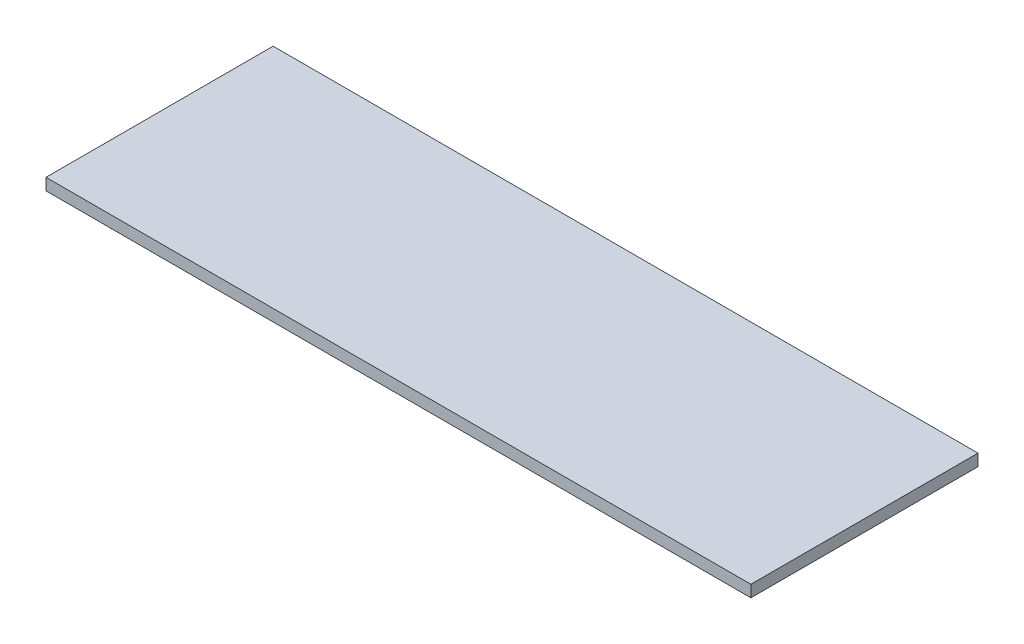
ISO-10303-21;
HEADER;
FILE_DESCRIPTION(('STEP AP214'),'2;1');
FILE_NAME('part.step','',(''),(''),'','','');
FILE_SCHEMA(('AUTOMOTIVE_DESIGN { 1 0 10303 214 1 1 1 1 }'));
ENDSEC;
DATA;
#1=APPLICATION_CONTEXT('core data for automotive mechanical design processes');
#2=APPLICATION_PROTOCOL_DEFINITION('international standard','automotive_design',2000,#1);
#3=PRODUCT_CONTEXT('',#1,'mechanical');
#4=PRODUCT('Part','Part','',(#3));
#5=PRODUCT_RELATED_PRODUCT_CATEGORY('part','',(#4));
#6=PRODUCT_DEFINITION_FORMATION('','',#4);
#7=PRODUCT_DEFINITION_CONTEXT('part definition',#1,'design');
#8=PRODUCT_DEFINITION('design','',#6,#7);
#9=PRODUCT_DEFINITION_SHAPE('','',#8);
#10=(LENGTH_UNIT() NAMED_UNIT(*) SI_UNIT(.MILLI.,.METRE.));
#11=(NAMED_UNIT(*) PLANE_ANGLE_UNIT() SI_UNIT($,.RADIAN.));
#12=(NAMED_UNIT(*) SI_UNIT($,.STERADIAN.) SOLID_ANGLE_UNIT());
#13=UNCERTAINTY_MEASURE_WITH_UNIT(LENGTH_MEASURE(1.E-05),#10,'distance_accuracy_value','');
#14=(GEOMETRIC_REPRESENTATION_CONTEXT(3) GLOBAL_UNCERTAINTY_ASSIGNED_CONTEXT((#13)) GLOBAL_UNIT_ASSIGNED_CONTEXT((#10,
#11,#12)) REPRESENTATION_CONTEXT('',''));
#15=CARTESIAN_POINT('',(0.,0.,0.));
#16=DIRECTION('',(0.,0.,1.));
#17=DIRECTION('',(1.,0.,0.));
#18=AXIS2_PLACEMENT_3D('',#15,#16,#17);
#19=CARTESIAN_POINT('',(90.,3.,29.));
#20=DIRECTION('',(-1.,0.,0.));
#21=DIRECTION('',(0.,0.,1.));
#22=AXIS2_PLACEMENT_3D('',#19,#20,#21);
#23=PLANE('',#22);
#24=DIRECTION('',(0.,0.,-1.));
#25=VECTOR('',#24,1.);
#26=CARTESIAN_POINT('',(90.,0.,29.));
#27=LINE('',#26,#25);
#28=CARTESIAN_POINT('',(90.,0.,29.));
#29=VERTEX_POINT('',#28);
#30=CARTESIAN_POINT('',(90.,0.,-29.));
#31=VERTEX_POINT('',#30);
#32=EDGE_CURVE('E95',#29,#31,#27,.T.);
#33=ORIENTED_EDGE('',*,*,#32,.T.);
#34=DIRECTION('',(0.,-1.,0.));
#35=VECTOR('',#34,1.);
#36=CARTESIAN_POINT('',(90.,3.,-29.));
#37=LINE('',#36,#35);
#38=CARTESIAN_POINT('',(90.,3.,-29.));
#39=VERTEX_POINT('',#38);
#40=EDGE_CURVE('E11',#39,#31,#37,.T.);
#41=ORIENTED_EDGE('',*,*,#40,.F.);
#42=DIRECTION('',(0.,0.,-1.));
#43=VECTOR('',#42,1.);
#44=CARTESIAN_POINT('',(90.,3.,29.));
#45=LINE('',#44,#43);
#46=CARTESIAN_POINT('',(90.,3.,29.));
#47=VERTEX_POINT('',#46);
#48=EDGE_CURVE('E83',#47,#39,#45,.T.);
#49=ORIENTED_EDGE('',*,*,#48,.F.);
#50=DIRECTION('',(0.,-1.,0.));
#51=VECTOR('',#50,1.);
#52=CARTESIAN_POINT('',(90.,3.,29.));
#53=LINE('',#52,#51);
#54=EDGE_CURVE('E91',#47,#29,#53,.T.);
#55=ORIENTED_EDGE('',*,*,#54,.T.);
#56=EDGE_LOOP('',(#33,#41,#49,#55));
#57=FACE_BOUND('',#56,.T.);
#58=ADVANCED_FACE('F32',(#57),#23,.F.);
#59=CARTESIAN_POINT('',(-90.,3.,-29.));
#60=DIRECTION('',(0.,0.,1.));
#61=DIRECTION('',(1.,0.,0.));
#62=AXIS2_PLACEMENT_3D('',#59,#60,#61);
#63=PLANE('',#62);
#64=DIRECTION('',(-1.,0.,0.));
#65=VECTOR('',#64,1.);
#66=CARTESIAN_POINT('',(-90.,0.,-29.));
#67=LINE('',#66,#65);
#68=CARTESIAN_POINT('',(-90.,0.,-29.));
#69=VERTEX_POINT('',#68);
#70=EDGE_CURVE('E87',#31,#69,#67,.T.);
#71=ORIENTED_EDGE('',*,*,#70,.T.);
#72=DIRECTION('',(0.,-1.,0.));
#73=VECTOR('',#72,1.);
#74=CARTESIAN_POINT('',(-90.,3.,-29.));
#75=LINE('',#74,#73);
#76=CARTESIAN_POINT('',(-90.,3.,-29.));
#77=VERTEX_POINT('',#76);
#78=EDGE_CURVE('E40',#77,#69,#75,.T.);
#79=ORIENTED_EDGE('',*,*,#78,.F.);
#80=DIRECTION('',(-1.,0.,0.));
#81=VECTOR('',#80,1.);
#82=CARTESIAN_POINT('',(-90.,3.,-29.));
#83=LINE('',#82,#81);
#84=EDGE_CURVE('E78',#39,#77,#83,.T.);
#85=ORIENTED_EDGE('',*,*,#84,.F.);
#86=ORIENTED_EDGE('',*,*,#40,.T.);
#87=EDGE_LOOP('',(#71,#79,#85,#86));
#88=FACE_BOUND('',#87,.T.);
#89=ADVANCED_FACE('F86',(#88),#63,.F.);
#90=CARTESIAN_POINT('',(-90.,3.,29.));
#91=DIRECTION('',(1.,0.,0.));
#92=DIRECTION('',(0.,0.,-1.));
#93=AXIS2_PLACEMENT_3D('',#90,#91,#92);
#94=PLANE('',#93);
#95=DIRECTION('',(0.,0.,1.));
#96=VECTOR('',#95,1.);
#97=CARTESIAN_POINT('',(-90.,0.,29.));
#98=LINE('',#97,#96);
#99=CARTESIAN_POINT('',(-90.,0.,29.));
#100=VERTEX_POINT('',#99);
#101=EDGE_CURVE('E65',#69,#100,#98,.T.);
#102=ORIENTED_EDGE('',*,*,#101,.T.);
#103=DIRECTION('',(0.,-1.,0.));
#104=VECTOR('',#103,1.);
#105=CARTESIAN_POINT('',(-90.,3.,29.));
#106=LINE('',#105,#104);
#107=CARTESIAN_POINT('',(-90.,3.,29.));
#108=VERTEX_POINT('',#107);
#109=EDGE_CURVE('E88',#108,#100,#106,.T.);
#110=ORIENTED_EDGE('',*,*,#109,.F.);
#111=DIRECTION('',(0.,0.,1.));
#112=VECTOR('',#111,1.);
#113=CARTESIAN_POINT('',(-90.,3.,29.));
#114=LINE('',#113,#112);
#115=EDGE_CURVE('E81',#77,#108,#114,.T.);
#116=ORIENTED_EDGE('',*,*,#115,.F.);
#117=ORIENTED_EDGE('',*,*,#78,.T.);
#118=EDGE_LOOP('',(#102,#110,#116,#117));
#119=FACE_BOUND('',#118,.T.);
#120=ADVANCED_FACE('F89',(#119),#94,.F.);
#121=CARTESIAN_POINT('',(-90.,3.,29.));
#122=DIRECTION('',(0.,0.,-1.));
#123=DIRECTION('',(-1.,0.,0.));
#124=AXIS2_PLACEMENT_3D('',#121,#122,#123);
#125=PLANE('',#124);
#126=DIRECTION('',(1.,0.,0.));
#127=VECTOR('',#126,1.);
#128=CARTESIAN_POINT('',(-90.,0.,29.));
#129=LINE('',#128,#127);
#130=EDGE_CURVE('E71',#100,#29,#129,.T.);
#131=ORIENTED_EDGE('',*,*,#130,.T.);
#132=ORIENTED_EDGE('',*,*,#54,.F.);
#133=DIRECTION('',(1.,0.,0.));
#134=VECTOR('',#133,1.);
#135=CARTESIAN_POINT('',(-90.,3.,29.));
#136=LINE('',#135,#134);
#137=EDGE_CURVE('E48',#108,#47,#136,.T.);
#138=ORIENTED_EDGE('',*,*,#137,.F.);
#139=ORIENTED_EDGE('',*,*,#109,.T.);
#140=EDGE_LOOP('',(#131,#132,#138,#139));
#141=FACE_BOUND('',#140,.T.);
#142=ADVANCED_FACE('F102',(#141),#125,.F.);
#143=CARTESIAN_POINT('',(0.,3.,0.));
#144=DIRECTION('',(0.,-1.,0.));
#145=DIRECTION('',(0.,0.,-1.));
#146=AXIS2_PLACEMENT_3D('',#143,#144,#145);
#147=PLANE('',#146);
#148=ORIENTED_EDGE('',*,*,#48,.T.);
#149=ORIENTED_EDGE('',*,*,#84,.T.);
#150=ORIENTED_EDGE('',*,*,#115,.T.);
#151=ORIENTED_EDGE('',*,*,#137,.T.);
#152=EDGE_LOOP('',(#148,#149,#150,#151));
#153=FACE_BOUND('',#152,.T.);
#154=ADVANCED_FACE('F79',(#153),#147,.F.);
#155=CARTESIAN_POINT('',(0.,0.,0.));
#156=DIRECTION('',(0.,-1.,0.));
#157=DIRECTION('',(0.,0.,-1.));
#158=AXIS2_PLACEMENT_3D('',#155,#156,#157);
#159=PLANE('',#158);
#160=ORIENTED_EDGE('',*,*,#32,.F.);
#161=ORIENTED_EDGE('',*,*,#130,.F.);
#162=ORIENTED_EDGE('',*,*,#101,.F.);
#163=ORIENTED_EDGE('',*,*,#70,.F.);
#164=EDGE_LOOP('',(#160,#161,#162,#163));
#165=FACE_BOUND('',#164,.T.);
#166=ADVANCED_FACE('F105',(#165),#159,.T.);
#167=CLOSED_SHELL('',(#58,#89,#120,#142,#154,#166));
#168=MANIFOLD_SOLID_BREP('B2',#167);
#169=ADVANCED_BREP_SHAPE_REPRESENTATION('',(#18,#168),#14);
#170=SHAPE_DEFINITION_REPRESENTATION(#9,#169);
ENDSEC;
END-ISO-10303-21;
